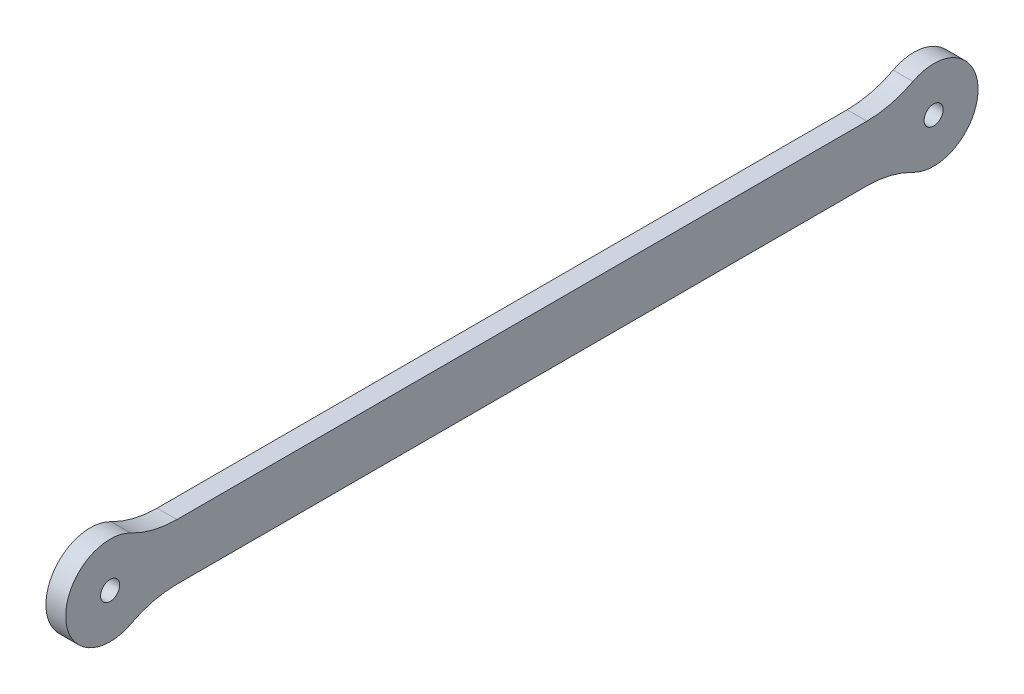
ISO-10303-21;
HEADER;
FILE_DESCRIPTION(('STEP AP214'),'2;1');
FILE_NAME('part.step','',(''),(''),'','','');
FILE_SCHEMA(('AUTOMOTIVE_DESIGN { 1 0 10303 214 1 1 1 1 }'));
ENDSEC;
DATA;
#1=APPLICATION_CONTEXT('core data for automotive mechanical design processes');
#2=APPLICATION_PROTOCOL_DEFINITION('international standard','automotive_design',2000,#1);
#3=PRODUCT_CONTEXT('',#1,'mechanical');
#4=PRODUCT('Part','Part','',(#3));
#5=PRODUCT_RELATED_PRODUCT_CATEGORY('part','',(#4));
#6=PRODUCT_DEFINITION_FORMATION('','',#4);
#7=PRODUCT_DEFINITION_CONTEXT('part definition',#1,'design');
#8=PRODUCT_DEFINITION('design','',#6,#7);
#9=PRODUCT_DEFINITION_SHAPE('','',#8);
#10=(LENGTH_UNIT() NAMED_UNIT(*) SI_UNIT(.MILLI.,.METRE.));
#11=(NAMED_UNIT(*) PLANE_ANGLE_UNIT() SI_UNIT($,.RADIAN.));
#12=(NAMED_UNIT(*) SI_UNIT($,.STERADIAN.) SOLID_ANGLE_UNIT());
#13=UNCERTAINTY_MEASURE_WITH_UNIT(LENGTH_MEASURE(1.E-05),#10,'distance_accuracy_value','');
#14=(GEOMETRIC_REPRESENTATION_CONTEXT(3) GLOBAL_UNCERTAINTY_ASSIGNED_CONTEXT((#13)) GLOBAL_UNIT_ASSIGNED_CONTEXT((#10,
#11,#12)) REPRESENTATION_CONTEXT('',''));
#15=CARTESIAN_POINT('',(0.,0.,0.));
#16=DIRECTION('',(0.,0.,1.));
#17=DIRECTION('',(1.,0.,0.));
#18=AXIS2_PLACEMENT_3D('',#15,#16,#17);
#19=CARTESIAN_POINT('',(1.5,4.25,0.));
#20=DIRECTION('',(0.,-1.,0.));
#21=DIRECTION('',(0.,0.,-1.));
#22=AXIS2_PLACEMENT_3D('',#19,#20,#21);
#23=PLANE('',#22);
#24=DIRECTION('',(0.,0.,1.));
#25=VECTOR('',#24,1.);
#26=CARTESIAN_POINT('',(1.5,4.25,0.));
#27=LINE('',#26,#25);
#28=CARTESIAN_POINT('',(1.5,4.25000000000001,-52.3757716343417));
#29=VERTEX_POINT('',#28);
#30=CARTESIAN_POINT('',(1.5,4.25,52.3757716343417));
#31=VERTEX_POINT('',#30);
#32=EDGE_CURVE('E117',#29,#31,#27,.T.);
#33=ORIENTED_EDGE('',*,*,#32,.F.);
#34=DIRECTION('',(1.,0.,0.));
#35=VECTOR('',#34,1.);
#36=CARTESIAN_POINT('',(-1.5,4.25000000000001,-52.3757716343417));
#37=LINE('',#36,#35);
#38=CARTESIAN_POINT('',(-1.5,4.25000000000001,-52.3757716343417));
#39=VERTEX_POINT('',#38);
#40=EDGE_CURVE('E104',#29,#39,#37,.F.);
#41=ORIENTED_EDGE('',*,*,#40,.T.);
#42=DIRECTION('',(0.,0.,1.));
#43=VECTOR('',#42,1.);
#44=CARTESIAN_POINT('',(-1.5,4.25,0.));
#45=LINE('',#44,#43);
#46=CARTESIAN_POINT('',(-1.5,4.25,52.3757716343417));
#47=VERTEX_POINT('',#46);
#48=EDGE_CURVE('E115',#39,#47,#45,.T.);
#49=ORIENTED_EDGE('',*,*,#48,.T.);
#50=DIRECTION('',(1.,0.,0.));
#51=VECTOR('',#50,1.);
#52=CARTESIAN_POINT('',(1.5,4.25,52.3757716343417));
#53=LINE('',#52,#51);
#54=EDGE_CURVE('E119',#47,#31,#53,.T.);
#55=ORIENTED_EDGE('',*,*,#54,.T.);
#56=EDGE_LOOP('',(#33,#41,#49,#55));
#57=FACE_BOUND('',#56,.T.);
#58=ADVANCED_FACE('F35',(#57),#23,.F.);
#59=CARTESIAN_POINT('',(1.5,0.,62.5));
#60=DIRECTION('',(-1.,0.,0.));
#61=DIRECTION('',(0.,0.,1.));
#62=AXIS2_PLACEMENT_3D('',#59,#60,#61);
#63=CYLINDRICAL_SURFACE('',#62,6.75);
#64=CARTESIAN_POINT('',(-1.5,0.,62.5));
#65=DIRECTION('',(1.,0.,0.));
#66=DIRECTION('',(0.,0.,-1.));
#67=AXIS2_PLACEMENT_3D('',#64,#65,#66);
#68=CIRCLE('',#67,6.75);
#69=CARTESIAN_POINT('',(-1.5,5.97413793103448,59.3579980934164));
#70=VERTEX_POINT('',#69);
#71=CARTESIAN_POINT('',(-1.5,-5.97413793103449,59.3579980934164));
#72=VERTEX_POINT('',#71);
#73=EDGE_CURVE('E124',#70,#72,#68,.T.);
#74=ORIENTED_EDGE('',*,*,#73,.T.);
#75=DIRECTION('',(-1.,0.,0.));
#76=VECTOR('',#75,1.);
#77=CARTESIAN_POINT('',(1.5,-5.97413793103449,59.3579980934164));
#78=LINE('',#77,#76);
#79=CARTESIAN_POINT('',(1.5,-5.97413793103449,59.3579980934164));
#80=VERTEX_POINT('',#79);
#81=EDGE_CURVE('E50',#72,#80,#78,.F.);
#82=ORIENTED_EDGE('',*,*,#81,.T.);
#83=CARTESIAN_POINT('',(1.5,0.,62.5));
#84=DIRECTION('',(1.,0.,0.));
#85=DIRECTION('',(0.,0.,-1.));
#86=AXIS2_PLACEMENT_3D('',#83,#84,#85);
#87=CIRCLE('',#86,6.75);
#88=CARTESIAN_POINT('',(1.5,5.97413793103448,59.3579980934164));
#89=VERTEX_POINT('',#88);
#90=EDGE_CURVE('E171',#89,#80,#87,.T.);
#91=ORIENTED_EDGE('',*,*,#90,.F.);
#92=DIRECTION('',(-1.,0.,0.));
#93=VECTOR('',#92,1.);
#94=CARTESIAN_POINT('',(1.5,5.97413793103448,59.3579980934164));
#95=LINE('',#94,#93);
#96=EDGE_CURVE('E151',#89,#70,#95,.T.);
#97=ORIENTED_EDGE('',*,*,#96,.T.);
#98=EDGE_LOOP('',(#74,#82,#91,#97));
#99=FACE_BOUND('',#98,.T.);
#100=ADVANCED_FACE('F181',(#99),#63,.T.);
#101=CARTESIAN_POINT('',(1.5,-4.25,0.));
#102=DIRECTION('',(0.,-1.,0.));
#103=DIRECTION('',(0.,0.,-1.));
#104=AXIS2_PLACEMENT_3D('',#101,#102,#103);
#105=PLANE('',#104);
#106=DIRECTION('',(0.,0.,1.));
#107=VECTOR('',#106,1.);
#108=CARTESIAN_POINT('',(-1.5,-4.25,0.));
#109=LINE('',#108,#107);
#110=CARTESIAN_POINT('',(-1.5,-4.25,-52.3757716343417));
#111=VERTEX_POINT('',#110);
#112=CARTESIAN_POINT('',(-1.5,-4.25000000000001,52.3757716343417));
#113=VERTEX_POINT('',#112);
#114=EDGE_CURVE('E126',#111,#113,#109,.T.);
#115=ORIENTED_EDGE('',*,*,#114,.F.);
#116=DIRECTION('',(-1.,0.,0.));
#117=VECTOR('',#116,1.);
#118=CARTESIAN_POINT('',(1.5,-4.25,-52.3757716343417));
#119=LINE('',#118,#117);
#120=CARTESIAN_POINT('',(1.5,-4.25,-52.3757716343417));
#121=VERTEX_POINT('',#120);
#122=EDGE_CURVE('E149',#111,#121,#119,.F.);
#123=ORIENTED_EDGE('',*,*,#122,.T.);
#124=DIRECTION('',(0.,0.,1.));
#125=VECTOR('',#124,1.);
#126=CARTESIAN_POINT('',(1.5,-4.25,0.));
#127=LINE('',#126,#125);
#128=CARTESIAN_POINT('',(1.5,-4.25000000000001,52.3757716343417));
#129=VERTEX_POINT('',#128);
#130=EDGE_CURVE('E169',#121,#129,#127,.T.);
#131=ORIENTED_EDGE('',*,*,#130,.T.);
#132=DIRECTION('',(-1.,0.,0.));
#133=VECTOR('',#132,1.);
#134=CARTESIAN_POINT('',(1.5,-4.25000000000001,52.3757716343417));
#135=LINE('',#134,#133);
#136=EDGE_CURVE('E146',#129,#113,#135,.T.);
#137=ORIENTED_EDGE('',*,*,#136,.T.);
#138=EDGE_LOOP('',(#115,#123,#131,#137));
#139=FACE_BOUND('',#138,.T.);
#140=ADVANCED_FACE('F176',(#139),#105,.T.);
#141=CARTESIAN_POINT('',(1.5,0.,62.5));
#142=DIRECTION('',(-1.,0.,0.));
#143=DIRECTION('',(0.,0.,1.));
#144=AXIS2_PLACEMENT_3D('',#141,#142,#143);
#145=CYLINDRICAL_SURFACE('',#144,1.45);
#146=CARTESIAN_POINT('',(1.5,0.,62.5));
#147=DIRECTION('',(1.,0.,0.));
#148=DIRECTION('',(0.,0.,-1.));
#149=AXIS2_PLACEMENT_3D('',#146,#147,#148);
#150=CIRCLE('',#149,1.45);
#151=CARTESIAN_POINT('',(1.5,0.,61.05));
#152=VERTEX_POINT('',#151);
#153=EDGE_CURVE('E187',#152,#152,#150,.T.);
#154=ORIENTED_EDGE('',*,*,#153,.T.);
#155=EDGE_LOOP('',(#154));
#156=FACE_BOUND('',#155,.T.);
#157=CARTESIAN_POINT('',(-1.5,0.,62.5));
#158=DIRECTION('',(1.,0.,0.));
#159=DIRECTION('',(0.,0.,-1.));
#160=AXIS2_PLACEMENT_3D('',#157,#158,#159);
#161=CIRCLE('',#160,1.45);
#162=CARTESIAN_POINT('',(-1.5,0.,61.05));
#163=VERTEX_POINT('',#162);
#164=EDGE_CURVE('E136',#163,#163,#161,.T.);
#165=ORIENTED_EDGE('',*,*,#164,.F.);
#166=EDGE_LOOP('',(#165));
#167=FACE_BOUND('',#166,.T.);
#168=ADVANCED_FACE('F263',(#156,#167),#145,.F.);
#169=CARTESIAN_POINT('',(1.5,0.,-62.5));
#170=DIRECTION('',(-1.,0.,0.));
#171=DIRECTION('',(0.,0.,1.));
#172=AXIS2_PLACEMENT_3D('',#169,#170,#171);
#173=CYLINDRICAL_SURFACE('',#172,6.74999999999999);
#174=CARTESIAN_POINT('',(-1.5,0.,-62.5));
#175=DIRECTION('',(1.,0.,0.));
#176=DIRECTION('',(0.,0.,-1.));
#177=AXIS2_PLACEMENT_3D('',#174,#175,#176);
#178=CIRCLE('',#177,6.74999999999999);
#179=CARTESIAN_POINT('',(-1.5,-5.97413793103448,-59.3579980934164));
#180=VERTEX_POINT('',#179);
#181=CARTESIAN_POINT('',(-1.5,5.97413793103448,-59.3579980934164));
#182=VERTEX_POINT('',#181);
#183=EDGE_CURVE('E134',#180,#182,#178,.T.);
#184=ORIENTED_EDGE('',*,*,#183,.T.);
#185=DIRECTION('',(-1.,0.,0.));
#186=VECTOR('',#185,1.);
#187=CARTESIAN_POINT('',(1.5,5.97413793103448,-59.3579980934164));
#188=LINE('',#187,#186);
#189=CARTESIAN_POINT('',(1.5,5.97413793103448,-59.3579980934164));
#190=VERTEX_POINT('',#189);
#191=EDGE_CURVE('E105',#182,#190,#188,.F.);
#192=ORIENTED_EDGE('',*,*,#191,.T.);
#193=CARTESIAN_POINT('',(1.5,0.,-62.5));
#194=DIRECTION('',(1.,0.,0.));
#195=DIRECTION('',(0.,0.,-1.));
#196=AXIS2_PLACEMENT_3D('',#193,#194,#195);
#197=CIRCLE('',#196,6.74999999999999);
#198=CARTESIAN_POINT('',(1.5,-5.97413793103448,-59.3579980934164));
#199=VERTEX_POINT('',#198);
#200=EDGE_CURVE('E178',#199,#190,#197,.T.);
#201=ORIENTED_EDGE('',*,*,#200,.F.);
#202=DIRECTION('',(-1.,0.,0.));
#203=VECTOR('',#202,1.);
#204=CARTESIAN_POINT('',(1.5,-5.97413793103448,-59.3579980934164));
#205=LINE('',#204,#203);
#206=EDGE_CURVE('E118',#199,#180,#205,.T.);
#207=ORIENTED_EDGE('',*,*,#206,.T.);
#208=EDGE_LOOP('',(#184,#192,#201,#207));
#209=FACE_BOUND('',#208,.T.);
#210=ADVANCED_FACE('F204',(#209),#173,.T.);
#211=CARTESIAN_POINT('',(1.5,0.,-62.5));
#212=DIRECTION('',(-1.,0.,0.));
#213=DIRECTION('',(0.,0.,1.));
#214=AXIS2_PLACEMENT_3D('',#211,#212,#213);
#215=CYLINDRICAL_SURFACE('',#214,1.45000000000001);
#216=CARTESIAN_POINT('',(1.5,0.,-62.5));
#217=DIRECTION('',(1.,0.,0.));
#218=DIRECTION('',(0.,0.,-1.));
#219=AXIS2_PLACEMENT_3D('',#216,#217,#218);
#220=CIRCLE('',#219,1.45000000000001);
#221=CARTESIAN_POINT('',(1.5,0.,-63.95));
#222=VERTEX_POINT('',#221);
#223=EDGE_CURVE('E129',#222,#222,#220,.T.);
#224=ORIENTED_EDGE('',*,*,#223,.T.);
#225=EDGE_LOOP('',(#224));
#226=FACE_BOUND('',#225,.T.);
#227=CARTESIAN_POINT('',(-1.5,0.,-62.5));
#228=DIRECTION('',(1.,0.,0.));
#229=DIRECTION('',(0.,0.,-1.));
#230=AXIS2_PLACEMENT_3D('',#227,#228,#229);
#231=CIRCLE('',#230,1.45000000000001);
#232=CARTESIAN_POINT('',(-1.5,0.,-63.95));
#233=VERTEX_POINT('',#232);
#234=EDGE_CURVE('E139',#233,#233,#231,.T.);
#235=ORIENTED_EDGE('',*,*,#234,.F.);
#236=EDGE_LOOP('',(#235));
#237=FACE_BOUND('',#236,.T.);
#238=ADVANCED_FACE('F194',(#226,#237),#215,.F.);
#239=CARTESIAN_POINT('',(1.5,0.,0.));
#240=DIRECTION('',(1.,0.,0.));
#241=DIRECTION('',(0.,0.,-1.));
#242=AXIS2_PLACEMENT_3D('',#239,#240,#241);
#243=PLANE('',#242);
#244=ORIENTED_EDGE('',*,*,#200,.T.);
#245=CARTESIAN_POINT('',(1.5,19.25,-52.3757716343417));
#246=DIRECTION('',(1.,0.,0.));
#247=DIRECTION('',(0.,0.,-1.));
#248=AXIS2_PLACEMENT_3D('',#245,#246,#247);
#249=CIRCLE('',#248,15.);
#250=EDGE_CURVE('E110',#190,#29,#249,.F.);
#251=ORIENTED_EDGE('',*,*,#250,.T.);
#252=ORIENTED_EDGE('',*,*,#32,.T.);
#253=CARTESIAN_POINT('',(1.5,19.25,52.3757716343417));
#254=DIRECTION('',(1.,0.,0.));
#255=DIRECTION('',(0.,0.,-1.));
#256=AXIS2_PLACEMENT_3D('',#253,#254,#255);
#257=CIRCLE('',#256,15.);
#258=EDGE_CURVE('E11',#31,#89,#257,.F.);
#259=ORIENTED_EDGE('',*,*,#258,.T.);
#260=ORIENTED_EDGE('',*,*,#90,.T.);
#261=CARTESIAN_POINT('',(1.5,-19.25,52.3757716343417));
#262=DIRECTION('',(1.,0.,0.));
#263=DIRECTION('',(0.,0.,-1.));
#264=AXIS2_PLACEMENT_3D('',#261,#262,#263);
#265=CIRCLE('',#264,15.);
#266=EDGE_CURVE('E162',#80,#129,#265,.F.);
#267=ORIENTED_EDGE('',*,*,#266,.T.);
#268=ORIENTED_EDGE('',*,*,#130,.F.);
#269=CARTESIAN_POINT('',(1.5,-19.25,-52.3757716343417));
#270=DIRECTION('',(1.,0.,0.));
#271=DIRECTION('',(0.,0.,-1.));
#272=AXIS2_PLACEMENT_3D('',#269,#270,#271);
#273=CIRCLE('',#272,15.);
#274=EDGE_CURVE('E158',#121,#199,#273,.F.);
#275=ORIENTED_EDGE('',*,*,#274,.T.);
#276=EDGE_LOOP('',(#244,#251,#252,#259,#260,#267,#268,#275));
#277=FACE_BOUND('',#276,.T.);
#278=ORIENTED_EDGE('',*,*,#153,.F.);
#279=EDGE_LOOP('',(#278));
#280=FACE_BOUND('',#279,.T.);
#281=ORIENTED_EDGE('',*,*,#223,.F.);
#282=EDGE_LOOP('',(#281));
#283=FACE_BOUND('',#282,.T.);
#284=ADVANCED_FACE('F167',(#277,#280,#283),#243,.T.);
#285=CARTESIAN_POINT('',(-1.5,0.,0.));
#286=DIRECTION('',(1.,0.,0.));
#287=DIRECTION('',(0.,0.,-1.));
#288=AXIS2_PLACEMENT_3D('',#285,#286,#287);
#289=PLANE('',#288);
#290=ORIENTED_EDGE('',*,*,#48,.F.);
#291=CARTESIAN_POINT('',(-1.5,19.25,-52.3757716343417));
#292=DIRECTION('',(1.,0.,0.));
#293=DIRECTION('',(0.,0.,-1.));
#294=AXIS2_PLACEMENT_3D('',#291,#292,#293);
#295=CIRCLE('',#294,15.);
#296=EDGE_CURVE('E100',#39,#182,#295,.T.);
#297=ORIENTED_EDGE('',*,*,#296,.T.);
#298=ORIENTED_EDGE('',*,*,#183,.F.);
#299=CARTESIAN_POINT('',(-1.5,-19.25,-52.3757716343417));
#300=DIRECTION('',(1.,0.,0.));
#301=DIRECTION('',(0.,0.,-1.));
#302=AXIS2_PLACEMENT_3D('',#299,#300,#301);
#303=CIRCLE('',#302,15.);
#304=EDGE_CURVE('E156',#180,#111,#303,.T.);
#305=ORIENTED_EDGE('',*,*,#304,.T.);
#306=ORIENTED_EDGE('',*,*,#114,.T.);
#307=CARTESIAN_POINT('',(-1.5,-19.25,52.3757716343417));
#308=DIRECTION('',(1.,0.,0.));
#309=DIRECTION('',(0.,0.,-1.));
#310=AXIS2_PLACEMENT_3D('',#307,#308,#309);
#311=CIRCLE('',#310,15.);
#312=EDGE_CURVE('E160',#113,#72,#311,.T.);
#313=ORIENTED_EDGE('',*,*,#312,.T.);
#314=ORIENTED_EDGE('',*,*,#73,.F.);
#315=CARTESIAN_POINT('',(-1.5,19.25,52.3757716343417));
#316=DIRECTION('',(1.,0.,0.));
#317=DIRECTION('',(0.,0.,-1.));
#318=AXIS2_PLACEMENT_3D('',#315,#316,#317);
#319=CIRCLE('',#318,15.);
#320=EDGE_CURVE('E43',#70,#47,#319,.T.);
#321=ORIENTED_EDGE('',*,*,#320,.T.);
#322=EDGE_LOOP('',(#290,#297,#298,#305,#306,#313,#314,#321));
#323=FACE_BOUND('',#322,.T.);
#324=ORIENTED_EDGE('',*,*,#164,.T.);
#325=EDGE_LOOP('',(#324));
#326=FACE_BOUND('',#325,.T.);
#327=ORIENTED_EDGE('',*,*,#234,.T.);
#328=EDGE_LOOP('',(#327));
#329=FACE_BOUND('',#328,.T.);
#330=ADVANCED_FACE('F121',(#323,#326,#329),#289,.F.);
#331=CARTESIAN_POINT('',(1.5,19.25,-52.3757716343417));
#332=DIRECTION('',(-1.,0.,0.));
#333=DIRECTION('',(0.,0.,1.));
#334=AXIS2_PLACEMENT_3D('',#331,#332,#333);
#335=CYLINDRICAL_SURFACE('',#334,15.);
#336=ORIENTED_EDGE('',*,*,#250,.F.);
#337=ORIENTED_EDGE('',*,*,#191,.F.);
#338=ORIENTED_EDGE('',*,*,#296,.F.);
#339=ORIENTED_EDGE('',*,*,#40,.F.);
#340=EDGE_LOOP('',(#336,#337,#338,#339));
#341=FACE_BOUND('',#340,.T.);
#342=ADVANCED_FACE('F103',(#341),#335,.F.);
#343=CARTESIAN_POINT('',(1.5,-19.25,-52.3757716343417));
#344=DIRECTION('',(-1.,0.,0.));
#345=DIRECTION('',(0.,0.,1.));
#346=AXIS2_PLACEMENT_3D('',#343,#344,#345);
#347=CYLINDRICAL_SURFACE('',#346,15.);
#348=ORIENTED_EDGE('',*,*,#274,.F.);
#349=ORIENTED_EDGE('',*,*,#122,.F.);
#350=ORIENTED_EDGE('',*,*,#304,.F.);
#351=ORIENTED_EDGE('',*,*,#206,.F.);
#352=EDGE_LOOP('',(#348,#349,#350,#351));
#353=FACE_BOUND('',#352,.T.);
#354=ADVANCED_FACE('F216',(#353),#347,.F.);
#355=CARTESIAN_POINT('',(1.5,-19.25,52.3757716343417));
#356=DIRECTION('',(-1.,0.,0.));
#357=DIRECTION('',(0.,0.,1.));
#358=AXIS2_PLACEMENT_3D('',#355,#356,#357);
#359=CYLINDRICAL_SURFACE('',#358,15.);
#360=ORIENTED_EDGE('',*,*,#266,.F.);
#361=ORIENTED_EDGE('',*,*,#81,.F.);
#362=ORIENTED_EDGE('',*,*,#312,.F.);
#363=ORIENTED_EDGE('',*,*,#136,.F.);
#364=EDGE_LOOP('',(#360,#361,#362,#363));
#365=FACE_BOUND('',#364,.T.);
#366=ADVANCED_FACE('F180',(#365),#359,.F.);
#367=CARTESIAN_POINT('',(1.5,19.25,52.3757716343417));
#368=DIRECTION('',(-1.,0.,0.));
#369=DIRECTION('',(0.,0.,1.));
#370=AXIS2_PLACEMENT_3D('',#367,#368,#369);
#371=CYLINDRICAL_SURFACE('',#370,15.);
#372=ORIENTED_EDGE('',*,*,#258,.F.);
#373=ORIENTED_EDGE('',*,*,#54,.F.);
#374=ORIENTED_EDGE('',*,*,#320,.F.);
#375=ORIENTED_EDGE('',*,*,#96,.F.);
#376=EDGE_LOOP('',(#372,#373,#374,#375));
#377=FACE_BOUND('',#376,.T.);
#378=ADVANCED_FACE('F37',(#377),#371,.F.);
#379=CLOSED_SHELL('',(#58,#100,#140,#168,#210,#238,#284,#330,#342,#354,#366,#378));
#380=MANIFOLD_SOLID_BREP('B2',#379);
#381=ADVANCED_BREP_SHAPE_REPRESENTATION('',(#18,#380),#14);
#382=SHAPE_DEFINITION_REPRESENTATION(#9,#381);
ENDSEC;
END-ISO-10303-21;
